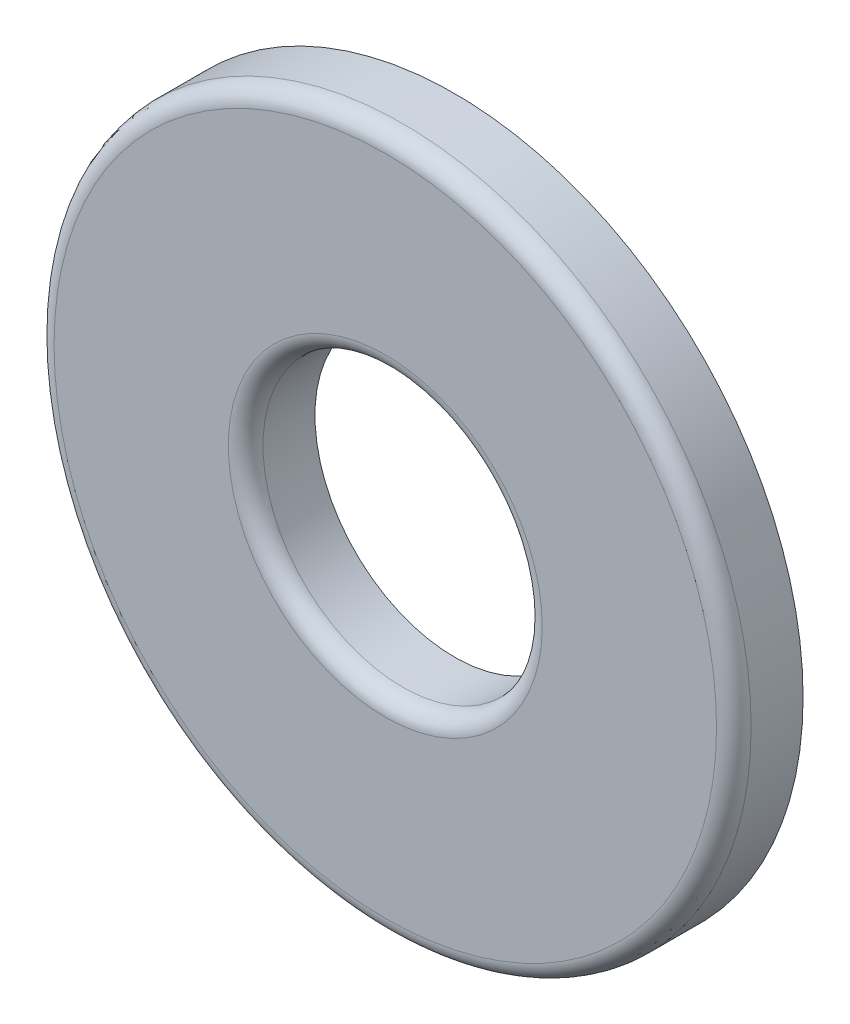
ISO-10303-21;
HEADER;
FILE_DESCRIPTION(('STEP AP214'),'2;1');
FILE_NAME('part.step','',(''),(''),'','','');
FILE_SCHEMA(('AUTOMOTIVE_DESIGN { 1 0 10303 214 1 1 1 1 }'));
ENDSEC;
DATA;
#1=APPLICATION_CONTEXT('core data for automotive mechanical design processes');
#2=APPLICATION_PROTOCOL_DEFINITION('international standard','automotive_design',2000,#1);
#3=PRODUCT_CONTEXT('',#1,'mechanical');
#4=PRODUCT('Part','Part','',(#3));
#5=PRODUCT_RELATED_PRODUCT_CATEGORY('part','',(#4));
#6=PRODUCT_DEFINITION_FORMATION('','',#4);
#7=PRODUCT_DEFINITION_CONTEXT('part definition',#1,'design');
#8=PRODUCT_DEFINITION('design','',#6,#7);
#9=PRODUCT_DEFINITION_SHAPE('','',#8);
#10=(LENGTH_UNIT() NAMED_UNIT(*) SI_UNIT(.MILLI.,.METRE.));
#11=(NAMED_UNIT(*) PLANE_ANGLE_UNIT() SI_UNIT($,.RADIAN.));
#12=(NAMED_UNIT(*) SI_UNIT($,.STERADIAN.) SOLID_ANGLE_UNIT());
#13=UNCERTAINTY_MEASURE_WITH_UNIT(LENGTH_MEASURE(1.E-05),#10,'distance_accuracy_value','');
#14=(GEOMETRIC_REPRESENTATION_CONTEXT(3) GLOBAL_UNCERTAINTY_ASSIGNED_CONTEXT((#13)) GLOBAL_UNIT_ASSIGNED_CONTEXT((#10,
#11,#12)) REPRESENTATION_CONTEXT('',''));
#15=CARTESIAN_POINT('',(0.,0.,0.));
#16=DIRECTION('',(0.,0.,1.));
#17=DIRECTION('',(1.,0.,0.));
#18=AXIS2_PLACEMENT_3D('',#15,#16,#17);
#19=CARTESIAN_POINT('',(0.,0.,0.393699999999996));
#20=DIRECTION('',(0.,0.,1.));
#21=DIRECTION('',(1.,0.,0.));
#22=AXIS2_PLACEMENT_3D('',#19,#20,#21);
#23=PLANE('',#22);
#24=CARTESIAN_POINT('',(0.,0.,0.393699999999996));
#25=DIRECTION('',(0.,0.,1.));
#26=DIRECTION('',(1.,0.,0.));
#27=AXIS2_PLACEMENT_3D('',#24,#25,#26);
#28=CIRCLE('',#27,3.76555);
#29=CARTESIAN_POINT('',(3.76555,0.,0.393699999999996));
#30=VERTEX_POINT('',#29);
#31=EDGE_CURVE('E46',#30,#30,#28,.T.);
#32=ORIENTED_EDGE('',*,*,#31,.T.);
#33=EDGE_LOOP('',(#32));
#34=FACE_BOUND('',#33,.T.);
#35=CARTESIAN_POINT('',(0.,0.,0.393699999999996));
#36=DIRECTION('',(0.,0.,1.));
#37=DIRECTION('',(1.,0.,0.));
#38=AXIS2_PLACEMENT_3D('',#35,#36,#37);
#39=CIRCLE('',#38,1.78435);
#40=CARTESIAN_POINT('',(1.78435,0.,0.393699999999996));
#41=VERTEX_POINT('',#40);
#42=EDGE_CURVE('E50',#41,#41,#39,.F.);
#43=ORIENTED_EDGE('',*,*,#42,.T.);
#44=EDGE_LOOP('',(#43));
#45=FACE_BOUND('',#44,.T.);
#46=ADVANCED_FACE('F35',(#34,#45),#23,.T.);
#47=CARTESIAN_POINT('',(0.,0.,0.393699999999996));
#48=DIRECTION('',(0.,0.,-1.));
#49=DIRECTION('',(-1.,0.,0.));
#50=AXIS2_PLACEMENT_3D('',#47,#48,#49);
#51=CYLINDRICAL_SURFACE('',#50,3.9624);
#52=CARTESIAN_POINT('',(0.,0.,0.196849999999996));
#53=DIRECTION('',(0.,0.,1.));
#54=DIRECTION('',(1.,0.,0.));
#55=AXIS2_PLACEMENT_3D('',#52,#53,#54);
#56=CIRCLE('',#55,3.9624);
#57=CARTESIAN_POINT('',(3.9624,0.,0.196849999999996));
#58=VERTEX_POINT('',#57);
#59=EDGE_CURVE('E42',#58,#58,#56,.F.);
#60=ORIENTED_EDGE('',*,*,#59,.T.);
#61=EDGE_LOOP('',(#60));
#62=FACE_BOUND('',#61,.T.);
#63=CARTESIAN_POINT('',(0.,0.,-0.393700000000004));
#64=DIRECTION('',(0.,0.,1.));
#65=DIRECTION('',(1.,0.,0.));
#66=AXIS2_PLACEMENT_3D('',#63,#64,#65);
#67=CIRCLE('',#66,3.9624);
#68=CARTESIAN_POINT('',(3.9624,0.,-0.393700000000004));
#69=VERTEX_POINT('',#68);
#70=EDGE_CURVE('E55',#69,#69,#67,.T.);
#71=ORIENTED_EDGE('',*,*,#70,.T.);
#72=EDGE_LOOP('',(#71));
#73=FACE_BOUND('',#72,.T.);
#74=ADVANCED_FACE('F67',(#62,#73),#51,.T.);
#75=CARTESIAN_POINT('',(0.,0.,0.393699999999996));
#76=DIRECTION('',(0.,0.,-1.));
#77=DIRECTION('',(-1.,0.,0.));
#78=AXIS2_PLACEMENT_3D('',#75,#76,#77);
#79=CYLINDRICAL_SURFACE('',#78,1.5875);
#80=CARTESIAN_POINT('',(0.,0.,0.196849999999996));
#81=DIRECTION('',(0.,0.,1.));
#82=DIRECTION('',(1.,0.,0.));
#83=AXIS2_PLACEMENT_3D('',#80,#81,#82);
#84=CIRCLE('',#83,1.5875);
#85=CARTESIAN_POINT('',(1.5875,0.,0.196849999999996));
#86=VERTEX_POINT('',#85);
#87=EDGE_CURVE('E10',#86,#86,#84,.T.);
#88=ORIENTED_EDGE('',*,*,#87,.T.);
#89=EDGE_LOOP('',(#88));
#90=FACE_BOUND('',#89,.T.);
#91=CARTESIAN_POINT('',(0.,0.,-0.393700000000004));
#92=DIRECTION('',(0.,0.,1.));
#93=DIRECTION('',(1.,0.,0.));
#94=AXIS2_PLACEMENT_3D('',#91,#92,#93);
#95=CIRCLE('',#94,1.5875);
#96=CARTESIAN_POINT('',(1.5875,0.,-0.393700000000004));
#97=VERTEX_POINT('',#96);
#98=EDGE_CURVE('E58',#97,#97,#95,.T.);
#99=ORIENTED_EDGE('',*,*,#98,.F.);
#100=EDGE_LOOP('',(#99));
#101=FACE_BOUND('',#100,.T.);
#102=ADVANCED_FACE('F65',(#90,#101),#79,.F.);
#103=CARTESIAN_POINT('',(0.,0.,-0.393700000000004));
#104=DIRECTION('',(0.,0.,1.));
#105=DIRECTION('',(1.,0.,0.));
#106=AXIS2_PLACEMENT_3D('',#103,#104,#105);
#107=PLANE('',#106);
#108=ORIENTED_EDGE('',*,*,#98,.T.);
#109=EDGE_LOOP('',(#108));
#110=FACE_BOUND('',#109,.T.);
#111=ORIENTED_EDGE('',*,*,#70,.F.);
#112=EDGE_LOOP('',(#111));
#113=FACE_BOUND('',#112,.T.);
#114=ADVANCED_FACE('F62',(#110,#113),#107,.F.);
#115=CARTESIAN_POINT('',(0.,0.,0.196849999999996));
#116=DIRECTION('',(0.,0.,1.));
#117=DIRECTION('',(1.,0.,0.));
#118=AXIS2_PLACEMENT_3D('',#115,#116,#117);
#119=TOROIDAL_SURFACE('',#118,3.76555,0.19685);
#120=ORIENTED_EDGE('',*,*,#59,.F.);
#121=EDGE_LOOP('',(#120));
#122=FACE_BOUND('',#121,.T.);
#123=ORIENTED_EDGE('',*,*,#31,.F.);
#124=EDGE_LOOP('',(#123));
#125=FACE_BOUND('',#124,.T.);
#126=ADVANCED_FACE('F73',(#122,#125),#119,.T.);
#127=CARTESIAN_POINT('',(0.,0.,0.196849999999996));
#128=DIRECTION('',(0.,0.,1.));
#129=DIRECTION('',(1.,0.,0.));
#130=AXIS2_PLACEMENT_3D('',#127,#128,#129);
#131=TOROIDAL_SURFACE('',#130,1.78435,0.19685);
#132=ORIENTED_EDGE('',*,*,#42,.F.);
#133=EDGE_LOOP('',(#132));
#134=FACE_BOUND('',#133,.T.);
#135=ORIENTED_EDGE('',*,*,#87,.F.);
#136=EDGE_LOOP('',(#135));
#137=FACE_BOUND('',#136,.T.);
#138=ADVANCED_FACE('F37',(#134,#137),#131,.T.);
#139=CLOSED_SHELL('',(#46,#74,#102,#114,#126,#138));
#140=MANIFOLD_SOLID_BREP('B2',#139);
#141=ADVANCED_BREP_SHAPE_REPRESENTATION('',(#18,#140),#14);
#142=SHAPE_DEFINITION_REPRESENTATION(#9,#141);
ENDSEC;
END-ISO-10303-21;
